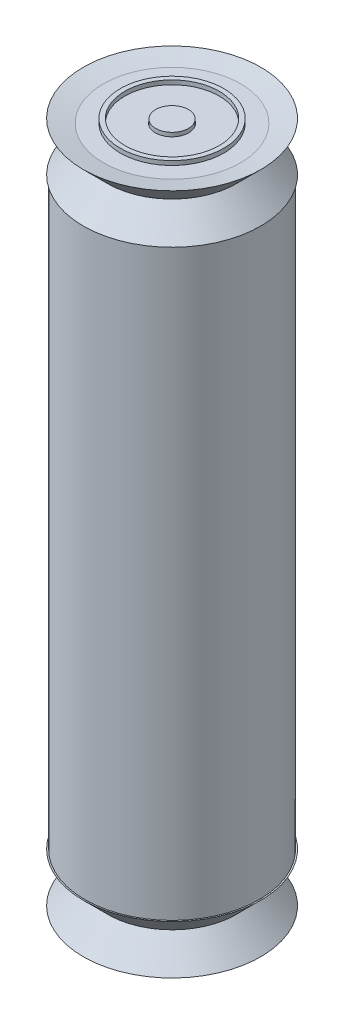
ISO-10303-21;
HEADER;
FILE_DESCRIPTION(('STEP AP214'),'2;1');
FILE_NAME('part.step','',(''),(''),'','','');
FILE_SCHEMA(('AUTOMOTIVE_DESIGN { 1 0 10303 214 1 1 1 1 }'));
ENDSEC;
DATA;
#1=APPLICATION_CONTEXT('core data for automotive mechanical design processes');
#2=APPLICATION_PROTOCOL_DEFINITION('international standard','automotive_design',2000,#1);
#3=PRODUCT_CONTEXT('',#1,'mechanical');
#4=PRODUCT('Part','Part','',(#3));
#5=PRODUCT_RELATED_PRODUCT_CATEGORY('part','',(#4));
#6=PRODUCT_DEFINITION_FORMATION('','',#4);
#7=PRODUCT_DEFINITION_CONTEXT('part definition',#1,'design');
#8=PRODUCT_DEFINITION('design','',#6,#7);
#9=PRODUCT_DEFINITION_SHAPE('','',#8);
#10=(LENGTH_UNIT() NAMED_UNIT(*) SI_UNIT(.MILLI.,.METRE.));
#11=(NAMED_UNIT(*) PLANE_ANGLE_UNIT() SI_UNIT($,.RADIAN.));
#12=(NAMED_UNIT(*) SI_UNIT($,.STERADIAN.) SOLID_ANGLE_UNIT());
#13=UNCERTAINTY_MEASURE_WITH_UNIT(LENGTH_MEASURE(1.E-05),#10,'distance_accuracy_value','');
#14=(GEOMETRIC_REPRESENTATION_CONTEXT(3) GLOBAL_UNCERTAINTY_ASSIGNED_CONTEXT((#13)) GLOBAL_UNIT_ASSIGNED_CONTEXT((#10,
#11,#12)) REPRESENTATION_CONTEXT('',''));
#15=CARTESIAN_POINT('',(0.,0.,0.));
#16=DIRECTION('',(0.,0.,1.));
#17=DIRECTION('',(1.,0.,0.));
#18=AXIS2_PLACEMENT_3D('',#15,#16,#17);
#19=CARTESIAN_POINT('',(-1.82793613295969,9.39922171623889,43.4186154580465));
#20=DIRECTION('',(0.,1.,0.));
#21=DIRECTION('',(0.425464661768097,0.,-0.904975039206363));
#22=AXIS2_PLACEMENT_3D('',#19,#20,#21);
#23=CONICAL_SURFACE('',#22,6.19514920305084,0.785398163397448);
#24=CARTESIAN_POINT('',(-1.82793613295969,7.69297305323575,43.4186154580465));
#25=DIRECTION('',(0.,-1.,0.));
#26=DIRECTION('',(-0.425464661768097,0.,0.904975039206363));
#27=AXIS2_PLACEMENT_3D('',#24,#25,#26);
#28=CIRCLE('',#27,4.4889005400477);
#29=CARTESIAN_POINT('',(-3.73780468294171,7.69297305323575,47.4809584002696));
#30=VERTEX_POINT('',#29);
#31=EDGE_CURVE('P0_E57',#30,#30,#28,.T.);
#32=ORIENTED_EDGE('',*,*,#31,.F.);
#33=EDGE_LOOP('',(#32));
#34=FACE_BOUND('',#33,.T.);
#35=CARTESIAN_POINT('',(-1.82793613295969,9.39922171623889,43.4186154580465));
#36=DIRECTION('',(0.,-1.,0.));
#37=DIRECTION('',(-0.425464661768097,0.,0.904975039206363));
#38=AXIS2_PLACEMENT_3D('',#35,#36,#37);
#39=CIRCLE('',#38,6.19514920305084);
#40=CARTESIAN_POINT('',(-4.46375319323861,9.39922171623889,49.0250708509667));
#41=VERTEX_POINT('',#40);
#42=EDGE_CURVE('P0_E9',#41,#41,#39,.T.);
#43=ORIENTED_EDGE('',*,*,#42,.T.);
#44=EDGE_LOOP('',(#43));
#45=FACE_BOUND('',#44,.T.);
#46=ADVANCED_FACE('P0_F14',(#34,#45),#23,.T.);
#47=CARTESIAN_POINT('',(-1.82793613295969,9.39922171623889,43.4186154580465));
#48=DIRECTION('',(0.,1.,0.));
#49=DIRECTION('',(0.425464661768097,0.,-0.904975039206363));
#50=AXIS2_PLACEMENT_3D('',#47,#48,#49);
#51=CONICAL_SURFACE('',#50,6.19514920305084,1.36416338296937);
#52=CARTESIAN_POINT('',(-1.82793613295969,9.10353314811628,43.4186154580465));
#53=DIRECTION('',(0.,-1.,0.));
#54=DIRECTION('',(-0.425464661768097,0.,0.904975039206363));
#55=AXIS2_PLACEMENT_3D('',#52,#53,#54);
#56=CIRCLE('',#55,4.78458910817031);
#57=CARTESIAN_POINT('',(-3.86360971956669,9.10353314811628,47.7485491737993));
#58=VERTEX_POINT('',#57);
#59=EDGE_CURVE('P0_E20',#58,#58,#56,.T.);
#60=ORIENTED_EDGE('',*,*,#59,.T.);
#61=EDGE_LOOP('',(#60));
#62=FACE_BOUND('',#61,.T.);
#63=ORIENTED_EDGE('',*,*,#42,.F.);
#64=EDGE_LOOP('',(#63));
#65=FACE_BOUND('',#64,.T.);
#66=ADVANCED_FACE('P0_F117',(#62,#65),#51,.F.);
#67=CARTESIAN_POINT('',(-7.59841786615679,9.10353314811628,55.6925888382047));
#68=DIRECTION('',(0.,1.,0.));
#69=DIRECTION('',(0.425464661768097,0.,-0.904975039206363));
#70=AXIS2_PLACEMENT_3D('',#67,#68,#69);
#71=PLANE('',#70);
#72=CARTESIAN_POINT('',(-1.82793613295969,9.10353314811628,43.4186154580465));
#73=DIRECTION('',(0.,-1.,0.));
#74=DIRECTION('',(-0.425464661768097,0.,0.904975039206363));
#75=AXIS2_PLACEMENT_3D('',#72,#73,#74);
#76=CIRCLE('',#75,3.61174190269609);
#77=CARTESIAN_POINT('',(-3.36460467998394,9.10353314811628,46.6871517280421));
#78=VERTEX_POINT('',#77);
#79=EDGE_CURVE('P0_E24',#78,#78,#76,.T.);
#80=ORIENTED_EDGE('',*,*,#79,.T.);
#81=EDGE_LOOP('',(#80));
#82=FACE_BOUND('',#81,.T.);
#83=ORIENTED_EDGE('',*,*,#59,.F.);
#84=EDGE_LOOP('',(#83));
#85=FACE_BOUND('',#84,.T.);
#86=ADVANCED_FACE('P0_F122',(#82,#85),#71,.T.);
#87=CARTESIAN_POINT('',(-1.82793613295969,9.10353314811628,43.4186154580465));
#88=DIRECTION('',(0.,-1.,0.));
#89=DIRECTION('',(-0.425464661768097,0.,0.904975039206363));
#90=AXIS2_PLACEMENT_3D('',#87,#88,#89);
#91=CYLINDRICAL_SURFACE('',#90,3.61174190269609);
#92=CARTESIAN_POINT('',(-1.82793613295969,9.39922171623889,43.4186154580465));
#93=DIRECTION('',(0.,-1.,0.));
#94=DIRECTION('',(-0.425464661768097,0.,0.904975039206363));
#95=AXIS2_PLACEMENT_3D('',#92,#93,#94);
#96=CIRCLE('',#95,3.61174190269609);
#97=CARTESIAN_POINT('',(-3.36460467998394,9.39922171623889,46.6871517280421));
#98=VERTEX_POINT('',#97);
#99=EDGE_CURVE('P0_E28',#98,#98,#96,.T.);
#100=ORIENTED_EDGE('',*,*,#99,.T.);
#101=EDGE_LOOP('',(#100));
#102=FACE_BOUND('',#101,.T.);
#103=ORIENTED_EDGE('',*,*,#79,.F.);
#104=EDGE_LOOP('',(#103));
#105=FACE_BOUND('',#104,.T.);
#106=ADVANCED_FACE('P0_F127',(#102,#105),#91,.T.);
#107=CARTESIAN_POINT('',(-7.59841786615679,9.39922171623889,55.6925888382047));
#108=DIRECTION('',(0.,1.,0.));
#109=DIRECTION('',(0.425464661768097,0.,-0.904975039206363));
#110=AXIS2_PLACEMENT_3D('',#107,#108,#109);
#111=PLANE('',#110);
#112=CARTESIAN_POINT('',(-1.82793613295969,9.39922171623889,43.4186154580465));
#113=DIRECTION('',(0.,-1.,0.));
#114=DIRECTION('',(-0.425464661768097,0.,0.904975039206363));
#115=AXIS2_PLACEMENT_3D('',#112,#113,#114);
#116=CIRCLE('',#115,3.29192884151118);
#117=CARTESIAN_POINT('',(-3.22853552407789,9.39922171623889,46.3977288904576));
#118=VERTEX_POINT('',#117);
#119=EDGE_CURVE('P0_E33',#118,#118,#116,.T.);
#120=ORIENTED_EDGE('',*,*,#119,.T.);
#121=EDGE_LOOP('',(#120));
#122=FACE_BOUND('',#121,.T.);
#123=ORIENTED_EDGE('',*,*,#99,.F.);
#124=EDGE_LOOP('',(#123));
#125=FACE_BOUND('',#124,.T.);
#126=ADVANCED_FACE('P0_F134',(#122,#125),#111,.T.);
#127=CARTESIAN_POINT('',(-1.82793613295969,9.10353314811628,43.4186154580465));
#128=DIRECTION('',(0.,-1.,0.));
#129=DIRECTION('',(-0.425464661768097,0.,0.904975039206363));
#130=AXIS2_PLACEMENT_3D('',#127,#128,#129);
#131=CYLINDRICAL_SURFACE('',#130,3.29192884151118);
#132=CARTESIAN_POINT('',(-1.82793613295969,9.10353314811628,43.4186154580465));
#133=DIRECTION('',(0.,-1.,0.));
#134=DIRECTION('',(-0.425464661768097,0.,0.904975039206363));
#135=AXIS2_PLACEMENT_3D('',#132,#133,#134);
#136=CIRCLE('',#135,3.29192884151118);
#137=CARTESIAN_POINT('',(-3.22853552407789,9.10353314811628,46.3977288904576));
#138=VERTEX_POINT('',#137);
#139=EDGE_CURVE('P0_E36',#138,#138,#136,.T.);
#140=ORIENTED_EDGE('',*,*,#139,.T.);
#141=EDGE_LOOP('',(#140));
#142=FACE_BOUND('',#141,.T.);
#143=ORIENTED_EDGE('',*,*,#119,.F.);
#144=EDGE_LOOP('',(#143));
#145=FACE_BOUND('',#144,.T.);
#146=ADVANCED_FACE('P0_F138',(#142,#145),#131,.F.);
#147=CARTESIAN_POINT('',(-7.59841786615679,9.10353314811628,55.6925888382047));
#148=DIRECTION('',(0.,1.,0.));
#149=DIRECTION('',(0.425464661768097,0.,-0.904975039206363));
#150=AXIS2_PLACEMENT_3D('',#147,#148,#149);
#151=PLANE('',#150);
#152=CARTESIAN_POINT('',(-1.82793613295969,9.10353314811628,43.4186154580465));
#153=DIRECTION('',(0.,1.,0.));
#154=DIRECTION('',(0.425464661768097,0.,-0.904975039206363));
#155=AXIS2_PLACEMENT_3D('',#152,#153,#154);
#156=CIRCLE('',#155,1.16077963846035);
#157=CARTESIAN_POINT('',(-1.33406541669486,9.10353314811628,42.3681388592209));
#158=VERTEX_POINT('',#157);
#159=EDGE_CURVE('P0_E60',#158,#158,#156,.T.);
#160=ORIENTED_EDGE('',*,*,#159,.F.);
#161=EDGE_LOOP('',(#160));
#162=FACE_BOUND('',#161,.T.);
#163=ORIENTED_EDGE('',*,*,#139,.F.);
#164=EDGE_LOOP('',(#163));
#165=FACE_BOUND('',#164,.T.);
#166=ADVANCED_FACE('P0_F73',(#162,#165),#151,.T.);
#167=CARTESIAN_POINT('',(-7.59841786615679,6.28241295835523,55.6925888382047));
#168=DIRECTION('',(0.,1.,0.));
#169=DIRECTION('',(0.425464661768097,0.,-0.904975039206363));
#170=AXIS2_PLACEMENT_3D('',#167,#168,#169);
#171=PLANE('',#170);
#172=CARTESIAN_POINT('',(-1.82793613295969,6.28241295835523,43.4186154580465));
#173=DIRECTION('',(0.,-1.,0.));
#174=DIRECTION('',(-0.425464661768097,0.,0.904975039206363));
#175=AXIS2_PLACEMENT_3D('',#172,#173,#174);
#176=CIRCLE('',#175,1.16077963846035);
#177=CARTESIAN_POINT('',(-2.32180684922451,6.28241295835523,44.4690920568721));
#178=VERTEX_POINT('',#177);
#179=EDGE_CURVE('P0_E63',#178,#178,#176,.T.);
#180=ORIENTED_EDGE('',*,*,#179,.F.);
#181=EDGE_LOOP('',(#180));
#182=FACE_BOUND('',#181,.T.);
#183=CARTESIAN_POINT('',(-1.82793613295969,6.28241295835523,43.4186154580465));
#184=DIRECTION('',(0.,-1.,0.));
#185=DIRECTION('',(-0.425464661768097,0.,0.904975039206363));
#186=AXIS2_PLACEMENT_3D('',#183,#184,#185);
#187=CIRCLE('',#186,3.29192884151118);
#188=CARTESIAN_POINT('',(-3.22853552407789,6.28241295835523,46.3977288904576));
#189=VERTEX_POINT('',#188);
#190=EDGE_CURVE('P0_E39',#189,#189,#187,.T.);
#191=ORIENTED_EDGE('',*,*,#190,.T.);
#192=EDGE_LOOP('',(#191));
#193=FACE_BOUND('',#192,.T.);
#194=ADVANCED_FACE('P0_F69',(#182,#193),#171,.F.);
#195=CARTESIAN_POINT('',(-1.82793613295969,9.10353314811628,43.4186154580465));
#196=DIRECTION('',(0.,-1.,0.));
#197=DIRECTION('',(-0.425464661768097,0.,0.904975039206363));
#198=AXIS2_PLACEMENT_3D('',#195,#196,#197);
#199=CYLINDRICAL_SURFACE('',#198,3.29192884151118);
#200=ORIENTED_EDGE('',*,*,#190,.F.);
#201=EDGE_LOOP('',(#200));
#202=FACE_BOUND('',#201,.T.);
#203=CARTESIAN_POINT('',(-1.82793613295969,5.98672439023262,43.4186154580465));
#204=DIRECTION('',(0.,-1.,0.));
#205=DIRECTION('',(-0.425464661768097,0.,0.904975039206363));
#206=AXIS2_PLACEMENT_3D('',#203,#204,#205);
#207=CIRCLE('',#206,3.29192884151118);
#208=CARTESIAN_POINT('',(-3.22853552407789,5.98672439023262,46.3977288904576));
#209=VERTEX_POINT('',#208);
#210=EDGE_CURVE('P0_E42',#209,#209,#207,.T.);
#211=ORIENTED_EDGE('',*,*,#210,.T.);
#212=EDGE_LOOP('',(#211));
#213=FACE_BOUND('',#212,.T.);
#214=ADVANCED_FACE('P0_F72',(#202,#213),#199,.F.);
#215=CARTESIAN_POINT('',(-7.59841786615679,5.98672439023262,55.6925888382047));
#216=DIRECTION('',(0.,1.,0.));
#217=DIRECTION('',(0.425464661768097,0.,-0.904975039206363));
#218=AXIS2_PLACEMENT_3D('',#215,#216,#217);
#219=PLANE('',#218);
#220=ORIENTED_EDGE('',*,*,#210,.F.);
#221=EDGE_LOOP('',(#220));
#222=FACE_BOUND('',#221,.T.);
#223=CARTESIAN_POINT('',(-1.82793613295969,5.98672439023262,43.4186154580465));
#224=DIRECTION('',(0.,-1.,0.));
#225=DIRECTION('',(-0.425464661768097,0.,0.904975039206363));
#226=AXIS2_PLACEMENT_3D('',#223,#224,#225);
#227=CIRCLE('',#226,3.61174190269609);
#228=CARTESIAN_POINT('',(-3.36460467998394,5.98672439023262,46.6871517280421));
#229=VERTEX_POINT('',#228);
#230=EDGE_CURVE('P0_E45',#229,#229,#227,.T.);
#231=ORIENTED_EDGE('',*,*,#230,.T.);
#232=EDGE_LOOP('',(#231));
#233=FACE_BOUND('',#232,.T.);
#234=ADVANCED_FACE('P0_F79',(#222,#233),#219,.F.);
#235=CARTESIAN_POINT('',(-1.82793613295969,9.10353314811628,43.4186154580465));
#236=DIRECTION('',(0.,-1.,0.));
#237=DIRECTION('',(-0.425464661768097,0.,0.904975039206363));
#238=AXIS2_PLACEMENT_3D('',#235,#236,#237);
#239=CYLINDRICAL_SURFACE('',#238,3.61174190269609);
#240=ORIENTED_EDGE('',*,*,#230,.F.);
#241=EDGE_LOOP('',(#240));
#242=FACE_BOUND('',#241,.T.);
#243=CARTESIAN_POINT('',(-1.82793613295969,6.28241295835523,43.4186154580465));
#244=DIRECTION('',(0.,-1.,0.));
#245=DIRECTION('',(-0.425464661768097,0.,0.904975039206363));
#246=AXIS2_PLACEMENT_3D('',#243,#244,#245);
#247=CIRCLE('',#246,3.61174190269609);
#248=CARTESIAN_POINT('',(-3.36460467998394,6.28241295835523,46.6871517280421));
#249=VERTEX_POINT('',#248);
#250=EDGE_CURVE('P0_E48',#249,#249,#247,.T.);
#251=ORIENTED_EDGE('',*,*,#250,.T.);
#252=EDGE_LOOP('',(#251));
#253=FACE_BOUND('',#252,.T.);
#254=ADVANCED_FACE('P0_F85',(#242,#253),#239,.T.);
#255=CARTESIAN_POINT('',(-7.59841786615679,6.28241295835523,55.6925888382047));
#256=DIRECTION('',(0.,1.,0.));
#257=DIRECTION('',(0.425464661768097,0.,-0.904975039206363));
#258=AXIS2_PLACEMENT_3D('',#255,#256,#257);
#259=PLANE('',#258);
#260=ORIENTED_EDGE('',*,*,#250,.F.);
#261=EDGE_LOOP('',(#260));
#262=FACE_BOUND('',#261,.T.);
#263=CARTESIAN_POINT('',(-1.82793613295969,6.28241295835523,43.4186154580465));
#264=DIRECTION('',(0.,-1.,0.));
#265=DIRECTION('',(-0.425464661768097,0.,0.904975039206363));
#266=AXIS2_PLACEMENT_3D('',#263,#264,#265);
#267=CIRCLE('',#266,4.78458910817031);
#268=CARTESIAN_POINT('',(-3.86360971956669,6.28241295835523,47.7485491737993));
#269=VERTEX_POINT('',#268);
#270=EDGE_CURVE('P0_E51',#269,#269,#267,.T.);
#271=ORIENTED_EDGE('',*,*,#270,.T.);
#272=EDGE_LOOP('',(#271));
#273=FACE_BOUND('',#272,.T.);
#274=ADVANCED_FACE('P0_F91',(#262,#273),#259,.F.);
#275=CARTESIAN_POINT('',(-1.82793613295969,5.98672439023262,43.4186154580465));
#276=DIRECTION('',(0.,-1.,0.));
#277=DIRECTION('',(-0.425464661768097,0.,0.904975039206363));
#278=AXIS2_PLACEMENT_3D('',#275,#276,#277);
#279=CONICAL_SURFACE('',#278,6.19514920305084,1.36416338296937);
#280=ORIENTED_EDGE('',*,*,#270,.F.);
#281=EDGE_LOOP('',(#280));
#282=FACE_BOUND('',#281,.T.);
#283=CARTESIAN_POINT('',(-1.82793613295969,5.98672439023262,43.4186154580465));
#284=DIRECTION('',(0.,-1.,0.));
#285=DIRECTION('',(-0.425464661768097,0.,0.904975039206363));
#286=AXIS2_PLACEMENT_3D('',#283,#284,#285);
#287=CIRCLE('',#286,6.19514920305084);
#288=CARTESIAN_POINT('',(-4.46375319323861,5.98672439023262,49.0250708509667));
#289=VERTEX_POINT('',#288);
#290=EDGE_CURVE('P0_E54',#289,#289,#287,.T.);
#291=ORIENTED_EDGE('',*,*,#290,.T.);
#292=EDGE_LOOP('',(#291));
#293=FACE_BOUND('',#292,.T.);
#294=ADVANCED_FACE('P0_F97',(#282,#293),#279,.F.);
#295=CARTESIAN_POINT('',(-1.82793613295969,5.98672439023262,43.4186154580465));
#296=DIRECTION('',(0.,-1.,0.));
#297=DIRECTION('',(-0.425464661768097,0.,0.904975039206363));
#298=AXIS2_PLACEMENT_3D('',#295,#296,#297);
#299=CONICAL_SURFACE('',#298,6.19514920305084,0.785398163397449);
#300=ORIENTED_EDGE('',*,*,#31,.T.);
#301=EDGE_LOOP('',(#300));
#302=FACE_BOUND('',#301,.T.);
#303=ORIENTED_EDGE('',*,*,#290,.F.);
#304=EDGE_LOOP('',(#303));
#305=FACE_BOUND('',#304,.T.);
#306=ADVANCED_FACE('P0_F103',(#302,#305),#299,.T.);
#307=CARTESIAN_POINT('',(-1.82793613295969,13.9024129583552,43.4186154580465));
#308=DIRECTION('',(0.,-1.,0.));
#309=DIRECTION('',(-0.425464661768097,0.,0.904975039206363));
#310=AXIS2_PLACEMENT_3D('',#307,#308,#309);
#311=CYLINDRICAL_SURFACE('',#310,1.16077963846035);
#312=ORIENTED_EDGE('',*,*,#159,.T.);
#313=EDGE_LOOP('',(#312));
#314=FACE_BOUND('',#313,.T.);
#315=ORIENTED_EDGE('',*,*,#179,.T.);
#316=EDGE_LOOP('',(#315));
#317=FACE_BOUND('',#316,.T.);
#318=ADVANCED_FACE('P0_F67',(#314,#317),#311,.F.);
#319=CLOSED_SHELL('',(#46,#66,#86,#106,#126,#146,#166,#194,#214,#234,#254,#274,#294,#306,#318));
#320=MANIFOLD_SOLID_BREP('P0_B1',#319);
#321=CARTESIAN_POINT('',(-1.82793613295969,50.1662217162389,43.4186154580465));
#322=DIRECTION('',(0.,-1.,0.));
#323=DIRECTION('',(0.,0.,-1.));
#324=AXIS2_PLACEMENT_3D('',#321,#322,#323);
#325=CYLINDRICAL_SURFACE('',#324,6.096);
#326=CARTESIAN_POINT('',(-1.82793613295969,50.1662217162389,43.4186154580465));
#327=DIRECTION('',(0.,1.,0.));
#328=DIRECTION('',(0.,0.,1.));
#329=AXIS2_PLACEMENT_3D('',#326,#327,#328);
#330=CIRCLE('',#329,6.096);
#331=CARTESIAN_POINT('',(-1.82793613295969,50.1662217162389,49.5146154580465));
#332=VERTEX_POINT('',#331);
#333=EDGE_CURVE('P1_E21',#332,#332,#330,.T.);
#334=ORIENTED_EDGE('',*,*,#333,.F.);
#335=EDGE_LOOP('',(#334));
#336=FACE_BOUND('',#335,.T.);
#337=CARTESIAN_POINT('',(-1.82793613295969,9.39922171623889,43.4186154580465));
#338=DIRECTION('',(0.,1.,0.));
#339=DIRECTION('',(0.,0.,1.));
#340=AXIS2_PLACEMENT_3D('',#337,#338,#339);
#341=CIRCLE('',#340,6.096);
#342=CARTESIAN_POINT('',(-1.82793613295969,9.39922171623889,49.5146154580465));
#343=VERTEX_POINT('',#342);
#344=EDGE_CURVE('P1_E25',#343,#343,#341,.T.);
#345=ORIENTED_EDGE('',*,*,#344,.T.);
#346=EDGE_LOOP('',(#345));
#347=FACE_BOUND('',#346,.T.);
#348=ADVANCED_FACE('P1_F15',(#336,#347),#325,.T.);
#349=CARTESIAN_POINT('',(-1.82793613295969,50.1662217162389,43.4186154580465));
#350=DIRECTION('',(0.,1.,0.));
#351=DIRECTION('',(0.,0.,1.));
#352=AXIS2_PLACEMENT_3D('',#349,#350,#351);
#353=PLANE('',#352);
#354=CARTESIAN_POINT('',(-1.82793613295969,50.1662217162389,43.4186154580465));
#355=DIRECTION('',(0.,1.,0.));
#356=DIRECTION('',(0.,0.,1.));
#357=AXIS2_PLACEMENT_3D('',#354,#355,#356);
#358=CIRCLE('',#357,1.143);
#359=CARTESIAN_POINT('',(-1.82793613295969,50.1662217162389,44.5616154580465));
#360=VERTEX_POINT('',#359);
#361=EDGE_CURVE('P1_E35',#360,#360,#358,.T.);
#362=ORIENTED_EDGE('',*,*,#361,.F.);
#363=EDGE_LOOP('',(#362));
#364=FACE_BOUND('',#363,.T.);
#365=ORIENTED_EDGE('',*,*,#333,.T.);
#366=EDGE_LOOP('',(#365));
#367=FACE_BOUND('',#366,.T.);
#368=ADVANCED_FACE('P1_F50',(#364,#367),#353,.T.);
#369=CARTESIAN_POINT('',(-1.82793613295969,9.39922171623889,43.4186154580465));
#370=DIRECTION('',(0.,1.,0.));
#371=DIRECTION('',(0.,0.,1.));
#372=AXIS2_PLACEMENT_3D('',#369,#370,#371);
#373=PLANE('',#372);
#374=CARTESIAN_POINT('',(-1.82793613295969,9.39922171623889,43.4186154580465));
#375=DIRECTION('',(0.,1.,0.));
#376=DIRECTION('',(0.,0.,1.));
#377=AXIS2_PLACEMENT_3D('',#374,#375,#376);
#378=CIRCLE('',#377,1.143);
#379=CARTESIAN_POINT('',(-1.82793613295969,9.39922171623889,44.5616154580465));
#380=VERTEX_POINT('',#379);
#381=EDGE_CURVE('P1_E10',#380,#380,#378,.F.);
#382=ORIENTED_EDGE('',*,*,#381,.F.);
#383=EDGE_LOOP('',(#382));
#384=FACE_BOUND('',#383,.T.);
#385=ORIENTED_EDGE('',*,*,#344,.F.);
#386=EDGE_LOOP('',(#385));
#387=FACE_BOUND('',#386,.T.);
#388=ADVANCED_FACE('P1_F52',(#384,#387),#373,.F.);
#389=CARTESIAN_POINT('',(-1.82793613295969,6.02102171623889,43.4186154580465));
#390=DIRECTION('',(0.,1.,0.));
#391=DIRECTION('',(0.,0.,1.));
#392=AXIS2_PLACEMENT_3D('',#389,#390,#391);
#393=CYLINDRICAL_SURFACE('',#392,1.143);
#394=CARTESIAN_POINT('',(-1.82793613295969,6.02102171623889,43.4186154580465));
#395=DIRECTION('',(0.,-1.,0.));
#396=DIRECTION('',(0.,0.,-1.));
#397=AXIS2_PLACEMENT_3D('',#394,#395,#396);
#398=CIRCLE('',#397,1.143);
#399=CARTESIAN_POINT('',(-1.82793613295969,6.02102171623889,42.2756154580465));
#400=VERTEX_POINT('',#399);
#401=EDGE_CURVE('P1_E30',#400,#400,#398,.T.);
#402=ORIENTED_EDGE('',*,*,#401,.F.);
#403=EDGE_LOOP('',(#402));
#404=FACE_BOUND('',#403,.T.);
#405=ORIENTED_EDGE('',*,*,#381,.T.);
#406=EDGE_LOOP('',(#405));
#407=FACE_BOUND('',#406,.T.);
#408=ADVANCED_FACE('P1_F59',(#404,#407),#393,.T.);
#409=CARTESIAN_POINT('',(-1.82793613295969,6.02102171623889,43.4186154580465));
#410=DIRECTION('',(0.,-1.,0.));
#411=DIRECTION('',(0.,0.,-1.));
#412=AXIS2_PLACEMENT_3D('',#409,#410,#411);
#413=PLANE('',#412);
#414=ORIENTED_EDGE('',*,*,#401,.T.);
#415=EDGE_LOOP('',(#414));
#416=FACE_BOUND('',#415,.T.);
#417=ADVANCED_FACE('P1_F46',(#416),#413,.T.);
#418=CARTESIAN_POINT('',(-1.82793613295969,53.5444217162389,43.4186154580465));
#419=DIRECTION('',(0.,-1.,0.));
#420=DIRECTION('',(0.,0.,-1.));
#421=AXIS2_PLACEMENT_3D('',#418,#419,#420);
#422=CYLINDRICAL_SURFACE('',#421,1.143);
#423=CARTESIAN_POINT('',(-1.82793613295969,53.5444217162389,43.4186154580465));
#424=DIRECTION('',(0.,1.,0.));
#425=DIRECTION('',(0.,0.,1.));
#426=AXIS2_PLACEMENT_3D('',#423,#424,#425);
#427=CIRCLE('',#426,1.143);
#428=CARTESIAN_POINT('',(-1.82793613295969,53.5444217162389,44.5616154580465));
#429=VERTEX_POINT('',#428);
#430=EDGE_CURVE('P1_E34',#429,#429,#427,.T.);
#431=ORIENTED_EDGE('',*,*,#430,.F.);
#432=EDGE_LOOP('',(#431));
#433=FACE_BOUND('',#432,.T.);
#434=ORIENTED_EDGE('',*,*,#361,.T.);
#435=EDGE_LOOP('',(#434));
#436=FACE_BOUND('',#435,.T.);
#437=ADVANCED_FACE('P1_F43',(#433,#436),#422,.T.);
#438=CARTESIAN_POINT('',(-1.82793613295969,53.5444217162389,43.4186154580465));
#439=DIRECTION('',(0.,1.,0.));
#440=DIRECTION('',(0.,0.,1.));
#441=AXIS2_PLACEMENT_3D('',#438,#439,#440);
#442=PLANE('',#441);
#443=ORIENTED_EDGE('',*,*,#430,.T.);
#444=EDGE_LOOP('',(#443));
#445=FACE_BOUND('',#444,.T.);
#446=ADVANCED_FACE('P1_F41',(#445),#442,.T.);
#447=CLOSED_SHELL('',(#348,#368,#388,#408,#417,#437,#446));
#448=MANIFOLD_SOLID_BREP('P1_B1',#447);
#449=CARTESIAN_POINT('',(-1.82793613295969,50.1662217162389,43.4186154580465));
#450=DIRECTION('',(0.,-1.,0.));
#451=DIRECTION('',(0.,0.,-1.));
#452=AXIS2_PLACEMENT_3D('',#449,#450,#451);
#453=CONICAL_SURFACE('',#452,6.19514920305084,0.785398163397448);
#454=CARTESIAN_POINT('',(-1.82793613295969,51.872470379242,43.4186154580465));
#455=DIRECTION('',(0.,1.,0.));
#456=DIRECTION('',(0.,0.,1.));
#457=AXIS2_PLACEMENT_3D('',#454,#455,#456);
#458=CIRCLE('',#457,4.4889005400477);
#459=CARTESIAN_POINT('',(-1.82793613295969,51.872470379242,47.9075159980942));
#460=VERTEX_POINT('',#459);
#461=EDGE_CURVE('P2_E58',#460,#460,#458,.T.);
#462=ORIENTED_EDGE('',*,*,#461,.F.);
#463=EDGE_LOOP('',(#462));
#464=FACE_BOUND('',#463,.T.);
#465=CARTESIAN_POINT('',(-1.82793613295969,50.1662217162389,43.4186154580465));
#466=DIRECTION('',(0.,1.,0.));
#467=DIRECTION('',(0.,0.,1.));
#468=AXIS2_PLACEMENT_3D('',#465,#466,#467);
#469=CIRCLE('',#468,6.19514920305084);
#470=CARTESIAN_POINT('',(-1.82793613295969,50.1662217162389,49.6137646610973));
#471=VERTEX_POINT('',#470);
#472=EDGE_CURVE('P2_E10',#471,#471,#469,.T.);
#473=ORIENTED_EDGE('',*,*,#472,.T.);
#474=EDGE_LOOP('',(#473));
#475=FACE_BOUND('',#474,.T.);
#476=ADVANCED_FACE('P2_F15',(#464,#475),#453,.T.);
#477=CARTESIAN_POINT('',(-1.82793613295969,50.1662217162389,43.4186154580465));
#478=DIRECTION('',(0.,-1.,0.));
#479=DIRECTION('',(0.,0.,-1.));
#480=AXIS2_PLACEMENT_3D('',#477,#478,#479);
#481=CONICAL_SURFACE('',#480,6.19514920305084,1.36416338296937);
#482=CARTESIAN_POINT('',(-1.82793613295969,50.4619102843615,43.4186154580465));
#483=DIRECTION('',(0.,1.,0.));
#484=DIRECTION('',(0.,0.,1.));
#485=AXIS2_PLACEMENT_3D('',#482,#483,#484);
#486=CIRCLE('',#485,4.78458910817031);
#487=CARTESIAN_POINT('',(-1.82793613295969,50.4619102843615,48.2032045662168));
#488=VERTEX_POINT('',#487);
#489=EDGE_CURVE('P2_E21',#488,#488,#486,.T.);
#490=ORIENTED_EDGE('',*,*,#489,.T.);
#491=EDGE_LOOP('',(#490));
#492=FACE_BOUND('',#491,.T.);
#493=ORIENTED_EDGE('',*,*,#472,.F.);
#494=EDGE_LOOP('',(#493));
#495=FACE_BOUND('',#494,.T.);
#496=ADVANCED_FACE('P2_F118',(#492,#495),#481,.F.);
#497=CARTESIAN_POINT('',(-1.82793613295969,50.4619102843615,56.9813910578267));
#498=DIRECTION('',(0.,-1.,0.));
#499=DIRECTION('',(0.,0.,-1.));
#500=AXIS2_PLACEMENT_3D('',#497,#498,#499);
#501=PLANE('',#500);
#502=CARTESIAN_POINT('',(-1.82793613295969,50.4619102843615,43.4186154580465));
#503=DIRECTION('',(0.,1.,0.));
#504=DIRECTION('',(0.,0.,1.));
#505=AXIS2_PLACEMENT_3D('',#502,#503,#504);
#506=CIRCLE('',#505,3.61174190269609);
#507=CARTESIAN_POINT('',(-1.82793613295969,50.4619102843615,47.0303573607426));
#508=VERTEX_POINT('',#507);
#509=EDGE_CURVE('P2_E25',#508,#508,#506,.T.);
#510=ORIENTED_EDGE('',*,*,#509,.T.);
#511=EDGE_LOOP('',(#510));
#512=FACE_BOUND('',#511,.T.);
#513=ORIENTED_EDGE('',*,*,#489,.F.);
#514=EDGE_LOOP('',(#513));
#515=FACE_BOUND('',#514,.T.);
#516=ADVANCED_FACE('P2_F123',(#512,#515),#501,.T.);
#517=CARTESIAN_POINT('',(-1.82793613295969,50.4619102843615,43.4186154580465));
#518=DIRECTION('',(0.,1.,0.));
#519=DIRECTION('',(0.,0.,1.));
#520=AXIS2_PLACEMENT_3D('',#517,#518,#519);
#521=CYLINDRICAL_SURFACE('',#520,3.61174190269609);
#522=CARTESIAN_POINT('',(-1.82793613295969,50.1662217162389,43.4186154580465));
#523=DIRECTION('',(0.,1.,0.));
#524=DIRECTION('',(0.,0.,1.));
#525=AXIS2_PLACEMENT_3D('',#522,#523,#524);
#526=CIRCLE('',#525,3.61174190269609);
#527=CARTESIAN_POINT('',(-1.82793613295969,50.1662217162389,47.0303573607426));
#528=VERTEX_POINT('',#527);
#529=EDGE_CURVE('P2_E29',#528,#528,#526,.T.);
#530=ORIENTED_EDGE('',*,*,#529,.T.);
#531=EDGE_LOOP('',(#530));
#532=FACE_BOUND('',#531,.T.);
#533=ORIENTED_EDGE('',*,*,#509,.F.);
#534=EDGE_LOOP('',(#533));
#535=FACE_BOUND('',#534,.T.);
#536=ADVANCED_FACE('P2_F128',(#532,#535),#521,.T.);
#537=CARTESIAN_POINT('',(-1.82793613295969,50.1662217162389,56.9813910578267));
#538=DIRECTION('',(0.,-1.,0.));
#539=DIRECTION('',(0.,0.,-1.));
#540=AXIS2_PLACEMENT_3D('',#537,#538,#539);
#541=PLANE('',#540);
#542=CARTESIAN_POINT('',(-1.82793613295969,50.1662217162389,43.4186154580465));
#543=DIRECTION('',(0.,1.,0.));
#544=DIRECTION('',(0.,0.,1.));
#545=AXIS2_PLACEMENT_3D('',#542,#543,#544);
#546=CIRCLE('',#545,3.29192884151118);
#547=CARTESIAN_POINT('',(-1.82793613295969,50.1662217162389,46.7105442995577));
#548=VERTEX_POINT('',#547);
#549=EDGE_CURVE('P2_E34',#548,#548,#546,.T.);
#550=ORIENTED_EDGE('',*,*,#549,.T.);
#551=EDGE_LOOP('',(#550));
#552=FACE_BOUND('',#551,.T.);
#553=ORIENTED_EDGE('',*,*,#529,.F.);
#554=EDGE_LOOP('',(#553));
#555=FACE_BOUND('',#554,.T.);
#556=ADVANCED_FACE('P2_F135',(#552,#555),#541,.T.);
#557=CARTESIAN_POINT('',(-1.82793613295969,50.4619102843615,43.4186154580465));
#558=DIRECTION('',(0.,1.,0.));
#559=DIRECTION('',(0.,0.,1.));
#560=AXIS2_PLACEMENT_3D('',#557,#558,#559);
#561=CYLINDRICAL_SURFACE('',#560,3.29192884151118);
#562=CARTESIAN_POINT('',(-1.82793613295969,50.4619102843615,43.4186154580465));
#563=DIRECTION('',(0.,1.,0.));
#564=DIRECTION('',(0.,0.,1.));
#565=AXIS2_PLACEMENT_3D('',#562,#563,#564);
#566=CIRCLE('',#565,3.29192884151118);
#567=CARTESIAN_POINT('',(-1.82793613295969,50.4619102843615,46.7105442995577));
#568=VERTEX_POINT('',#567);
#569=EDGE_CURVE('P2_E37',#568,#568,#566,.T.);
#570=ORIENTED_EDGE('',*,*,#569,.T.);
#571=EDGE_LOOP('',(#570));
#572=FACE_BOUND('',#571,.T.);
#573=ORIENTED_EDGE('',*,*,#549,.F.);
#574=EDGE_LOOP('',(#573));
#575=FACE_BOUND('',#574,.T.);
#576=ADVANCED_FACE('P2_F139',(#572,#575),#561,.F.);
#577=CARTESIAN_POINT('',(-1.82793613295969,50.4619102843615,56.9813910578267));
#578=DIRECTION('',(0.,-1.,0.));
#579=DIRECTION('',(0.,0.,-1.));
#580=AXIS2_PLACEMENT_3D('',#577,#578,#579);
#581=PLANE('',#580);
#582=CARTESIAN_POINT('',(-1.82793613295969,50.4619102843615,43.4186154580465));
#583=DIRECTION('',(0.,-1.,0.));
#584=DIRECTION('',(0.,0.,-1.));
#585=AXIS2_PLACEMENT_3D('',#582,#583,#584);
#586=CIRCLE('',#585,1.16077963846035);
#587=CARTESIAN_POINT('',(-1.82793613295969,50.4619102843615,42.2578358195861));
#588=VERTEX_POINT('',#587);
#589=EDGE_CURVE('P2_E61',#588,#588,#586,.T.);
#590=ORIENTED_EDGE('',*,*,#589,.F.);
#591=EDGE_LOOP('',(#590));
#592=FACE_BOUND('',#591,.T.);
#593=ORIENTED_EDGE('',*,*,#569,.F.);
#594=EDGE_LOOP('',(#593));
#595=FACE_BOUND('',#594,.T.);
#596=ADVANCED_FACE('P2_F74',(#592,#595),#581,.T.);
#597=CARTESIAN_POINT('',(-1.82793613295969,53.2830304741225,56.9813910578267));
#598=DIRECTION('',(0.,-1.,0.));
#599=DIRECTION('',(0.,0.,-1.));
#600=AXIS2_PLACEMENT_3D('',#597,#598,#599);
#601=PLANE('',#600);
#602=CARTESIAN_POINT('',(-1.82793613295969,53.2830304741225,43.4186154580465));
#603=DIRECTION('',(0.,1.,0.));
#604=DIRECTION('',(0.,0.,1.));
#605=AXIS2_PLACEMENT_3D('',#602,#603,#604);
#606=CIRCLE('',#605,1.16077963846035);
#607=CARTESIAN_POINT('',(-1.82793613295969,53.2830304741225,44.5793950965068));
#608=VERTEX_POINT('',#607);
#609=EDGE_CURVE('P2_E64',#608,#608,#606,.T.);
#610=ORIENTED_EDGE('',*,*,#609,.F.);
#611=EDGE_LOOP('',(#610));
#612=FACE_BOUND('',#611,.T.);
#613=CARTESIAN_POINT('',(-1.82793613295969,53.2830304741225,43.4186154580465));
#614=DIRECTION('',(0.,1.,0.));
#615=DIRECTION('',(0.,0.,1.));
#616=AXIS2_PLACEMENT_3D('',#613,#614,#615);
#617=CIRCLE('',#616,3.29192884151118);
#618=CARTESIAN_POINT('',(-1.82793613295969,53.2830304741225,46.7105442995577));
#619=VERTEX_POINT('',#618);
#620=EDGE_CURVE('P2_E40',#619,#619,#617,.T.);
#621=ORIENTED_EDGE('',*,*,#620,.T.);
#622=EDGE_LOOP('',(#621));
#623=FACE_BOUND('',#622,.T.);
#624=ADVANCED_FACE('P2_F70',(#612,#623),#601,.F.);
#625=CARTESIAN_POINT('',(-1.82793613295969,50.4619102843615,43.4186154580465));
#626=DIRECTION('',(0.,1.,0.));
#627=DIRECTION('',(0.,0.,1.));
#628=AXIS2_PLACEMENT_3D('',#625,#626,#627);
#629=CYLINDRICAL_SURFACE('',#628,3.29192884151118);
#630=ORIENTED_EDGE('',*,*,#620,.F.);
#631=EDGE_LOOP('',(#630));
#632=FACE_BOUND('',#631,.T.);
#633=CARTESIAN_POINT('',(-1.82793613295969,53.5787190422452,43.4186154580465));
#634=DIRECTION('',(0.,1.,0.));
#635=DIRECTION('',(0.,0.,1.));
#636=AXIS2_PLACEMENT_3D('',#633,#634,#635);
#637=CIRCLE('',#636,3.29192884151118);
#638=CARTESIAN_POINT('',(-1.82793613295969,53.5787190422452,46.7105442995577));
#639=VERTEX_POINT('',#638);
#640=EDGE_CURVE('P2_E43',#639,#639,#637,.T.);
#641=ORIENTED_EDGE('',*,*,#640,.T.);
#642=EDGE_LOOP('',(#641));
#643=FACE_BOUND('',#642,.T.);
#644=ADVANCED_FACE('P2_F73',(#632,#643),#629,.F.);
#645=CARTESIAN_POINT('',(-1.82793613295969,53.5787190422452,56.9813910578267));
#646=DIRECTION('',(0.,-1.,0.));
#647=DIRECTION('',(0.,0.,-1.));
#648=AXIS2_PLACEMENT_3D('',#645,#646,#647);
#649=PLANE('',#648);
#650=ORIENTED_EDGE('',*,*,#640,.F.);
#651=EDGE_LOOP('',(#650));
#652=FACE_BOUND('',#651,.T.);
#653=CARTESIAN_POINT('',(-1.82793613295969,53.5787190422452,43.4186154580465));
#654=DIRECTION('',(0.,1.,0.));
#655=DIRECTION('',(0.,0.,1.));
#656=AXIS2_PLACEMENT_3D('',#653,#654,#655);
#657=CIRCLE('',#656,3.61174190269609);
#658=CARTESIAN_POINT('',(-1.82793613295969,53.5787190422452,47.0303573607426));
#659=VERTEX_POINT('',#658);
#660=EDGE_CURVE('P2_E46',#659,#659,#657,.T.);
#661=ORIENTED_EDGE('',*,*,#660,.T.);
#662=EDGE_LOOP('',(#661));
#663=FACE_BOUND('',#662,.T.);
#664=ADVANCED_FACE('P2_F80',(#652,#663),#649,.F.);
#665=CARTESIAN_POINT('',(-1.82793613295969,50.4619102843615,43.4186154580465));
#666=DIRECTION('',(0.,1.,0.));
#667=DIRECTION('',(0.,0.,1.));
#668=AXIS2_PLACEMENT_3D('',#665,#666,#667);
#669=CYLINDRICAL_SURFACE('',#668,3.61174190269609);
#670=ORIENTED_EDGE('',*,*,#660,.F.);
#671=EDGE_LOOP('',(#670));
#672=FACE_BOUND('',#671,.T.);
#673=CARTESIAN_POINT('',(-1.82793613295969,53.2830304741225,43.4186154580465));
#674=DIRECTION('',(0.,1.,0.));
#675=DIRECTION('',(0.,0.,1.));
#676=AXIS2_PLACEMENT_3D('',#673,#674,#675);
#677=CIRCLE('',#676,3.61174190269609);
#678=CARTESIAN_POINT('',(-1.82793613295969,53.2830304741225,47.0303573607426));
#679=VERTEX_POINT('',#678);
#680=EDGE_CURVE('P2_E49',#679,#679,#677,.T.);
#681=ORIENTED_EDGE('',*,*,#680,.T.);
#682=EDGE_LOOP('',(#681));
#683=FACE_BOUND('',#682,.T.);
#684=ADVANCED_FACE('P2_F86',(#672,#683),#669,.T.);
#685=CARTESIAN_POINT('',(-1.82793613295969,53.2830304741225,56.9813910578267));
#686=DIRECTION('',(0.,-1.,0.));
#687=DIRECTION('',(0.,0.,-1.));
#688=AXIS2_PLACEMENT_3D('',#685,#686,#687);
#689=PLANE('',#688);
#690=ORIENTED_EDGE('',*,*,#680,.F.);
#691=EDGE_LOOP('',(#690));
#692=FACE_BOUND('',#691,.T.);
#693=CARTESIAN_POINT('',(-1.82793613295969,53.2830304741225,43.4186154580465));
#694=DIRECTION('',(0.,1.,0.));
#695=DIRECTION('',(0.,0.,1.));
#696=AXIS2_PLACEMENT_3D('',#693,#694,#695);
#697=CIRCLE('',#696,4.78458910817031);
#698=CARTESIAN_POINT('',(-1.82793613295969,53.2830304741225,48.2032045662168));
#699=VERTEX_POINT('',#698);
#700=EDGE_CURVE('P2_E52',#699,#699,#697,.T.);
#701=ORIENTED_EDGE('',*,*,#700,.T.);
#702=EDGE_LOOP('',(#701));
#703=FACE_BOUND('',#702,.T.);
#704=ADVANCED_FACE('P2_F92',(#692,#703),#689,.F.);
#705=CARTESIAN_POINT('',(-1.82793613295969,53.5787190422452,43.4186154580465));
#706=DIRECTION('',(0.,1.,0.));
#707=DIRECTION('',(0.,0.,1.));
#708=AXIS2_PLACEMENT_3D('',#705,#706,#707);
#709=CONICAL_SURFACE('',#708,6.19514920305084,1.36416338296937);
#710=ORIENTED_EDGE('',*,*,#700,.F.);
#711=EDGE_LOOP('',(#710));
#712=FACE_BOUND('',#711,.T.);
#713=CARTESIAN_POINT('',(-1.82793613295969,53.5787190422452,43.4186154580465));
#714=DIRECTION('',(0.,1.,0.));
#715=DIRECTION('',(0.,0.,1.));
#716=AXIS2_PLACEMENT_3D('',#713,#714,#715);
#717=CIRCLE('',#716,6.19514920305084);
#718=CARTESIAN_POINT('',(-1.82793613295969,53.5787190422452,49.6137646610973));
#719=VERTEX_POINT('',#718);
#720=EDGE_CURVE('P2_E55',#719,#719,#717,.T.);
#721=ORIENTED_EDGE('',*,*,#720,.T.);
#722=EDGE_LOOP('',(#721));
#723=FACE_BOUND('',#722,.T.);
#724=ADVANCED_FACE('P2_F98',(#712,#723),#709,.F.);
#725=CARTESIAN_POINT('',(-1.82793613295969,53.5787190422452,43.4186154580465));
#726=DIRECTION('',(0.,1.,0.));
#727=DIRECTION('',(0.,0.,1.));
#728=AXIS2_PLACEMENT_3D('',#725,#726,#727);
#729=CONICAL_SURFACE('',#728,6.19514920305084,0.785398163397449);
#730=ORIENTED_EDGE('',*,*,#461,.T.);
#731=EDGE_LOOP('',(#730));
#732=FACE_BOUND('',#731,.T.);
#733=ORIENTED_EDGE('',*,*,#720,.F.);
#734=EDGE_LOOP('',(#733));
#735=FACE_BOUND('',#734,.T.);
#736=ADVANCED_FACE('P2_F104',(#732,#735),#729,.T.);
#737=CARTESIAN_POINT('',(-1.82793613295969,45.6630304741226,43.4186154580465));
#738=DIRECTION('',(0.,1.,0.));
#739=DIRECTION('',(0.,0.,1.));
#740=AXIS2_PLACEMENT_3D('',#737,#738,#739);
#741=CYLINDRICAL_SURFACE('',#740,1.16077963846035);
#742=ORIENTED_EDGE('',*,*,#589,.T.);
#743=EDGE_LOOP('',(#742));
#744=FACE_BOUND('',#743,.T.);
#745=ORIENTED_EDGE('',*,*,#609,.T.);
#746=EDGE_LOOP('',(#745));
#747=FACE_BOUND('',#746,.T.);
#748=ADVANCED_FACE('P2_F68',(#744,#747),#741,.F.);
#749=CLOSED_SHELL('',(#476,#496,#516,#536,#556,#576,#596,#624,#644,#664,#684,#704,#724,#736,#748));
#750=MANIFOLD_SOLID_BREP('P2_B1',#749);
#751=ADVANCED_BREP_SHAPE_REPRESENTATION('',(#18,#320,#448,#750),#14);
#752=SHAPE_DEFINITION_REPRESENTATION(#9,#751);
ENDSEC;
END-ISO-10303-21;
